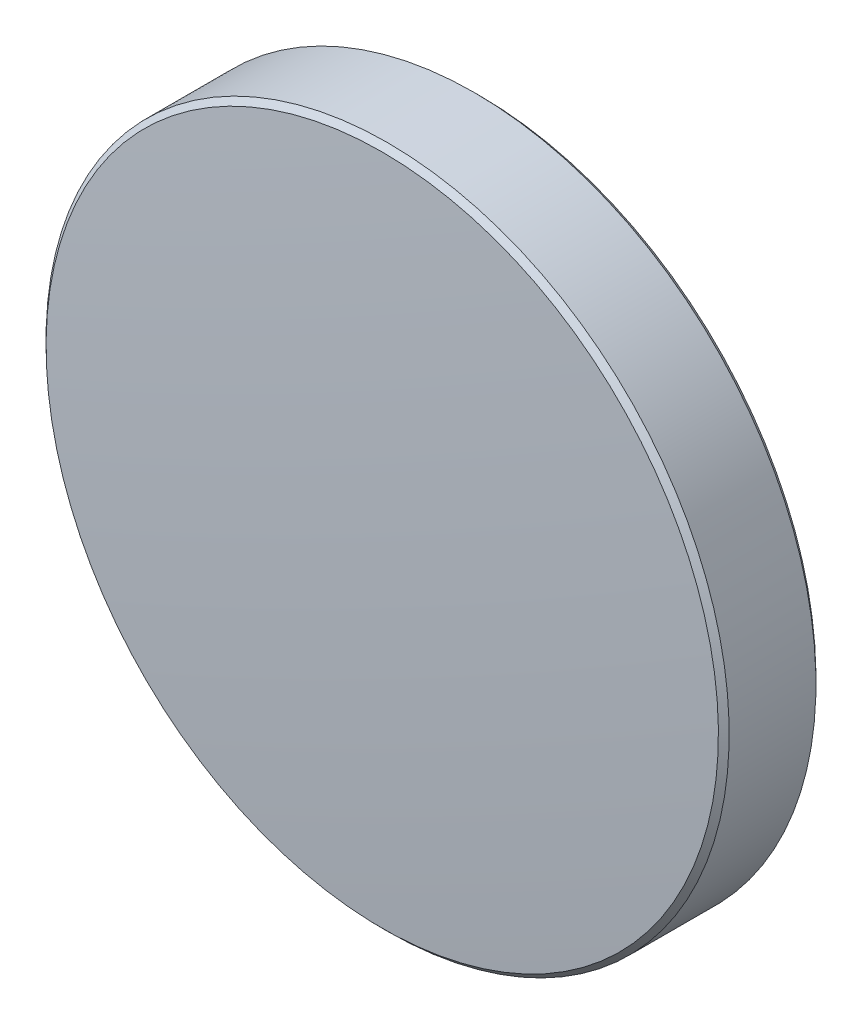
ISO-10303-21;
HEADER;
FILE_DESCRIPTION(('STEP AP214'),'2;1');
FILE_NAME('part.step','',(''),(''),'','','');
FILE_SCHEMA(('AUTOMOTIVE_DESIGN { 1 0 10303 214 1 1 1 1 }'));
ENDSEC;
DATA;
#1=APPLICATION_CONTEXT('core data for automotive mechanical design processes');
#2=APPLICATION_PROTOCOL_DEFINITION('international standard','automotive_design',2000,#1);
#3=PRODUCT_CONTEXT('',#1,'mechanical');
#4=PRODUCT('Part','Part','',(#3));
#5=PRODUCT_RELATED_PRODUCT_CATEGORY('part','',(#4));
#6=PRODUCT_DEFINITION_FORMATION('','',#4);
#7=PRODUCT_DEFINITION_CONTEXT('part definition',#1,'design');
#8=PRODUCT_DEFINITION('design','',#6,#7);
#9=PRODUCT_DEFINITION_SHAPE('','',#8);
#10=(LENGTH_UNIT() NAMED_UNIT(*) SI_UNIT(.MILLI.,.METRE.));
#11=(NAMED_UNIT(*) PLANE_ANGLE_UNIT() SI_UNIT($,.RADIAN.));
#12=(NAMED_UNIT(*) SI_UNIT($,.STERADIAN.) SOLID_ANGLE_UNIT());
#13=UNCERTAINTY_MEASURE_WITH_UNIT(LENGTH_MEASURE(1.E-05),#10,'distance_accuracy_value','');
#14=(GEOMETRIC_REPRESENTATION_CONTEXT(3) GLOBAL_UNCERTAINTY_ASSIGNED_CONTEXT((#13)) GLOBAL_UNIT_ASSIGNED_CONTEXT((#10,
#11,#12)) REPRESENTATION_CONTEXT('',''));
#15=CARTESIAN_POINT('',(0.,0.,0.));
#16=DIRECTION('',(0.,0.,1.));
#17=DIRECTION('',(1.,0.,0.));
#18=AXIS2_PLACEMENT_3D('',#15,#16,#17);
#19=CARTESIAN_POINT('',(0.,0.,-2.));
#20=DIRECTION('',(0.,0.,-1.));
#21=DIRECTION('',(0.,1.,0.));
#22=AXIS2_PLACEMENT_3D('',#19,#20,#21);
#23=CYLINDRICAL_SURFACE('',#22,12.7);
#24=CARTESIAN_POINT('',(0.,0.,1.42586129241057));
#25=DIRECTION('',(0.,0.,-1.));
#26=DIRECTION('',(0.,1.,0.));
#27=AXIS2_PLACEMENT_3D('',#24,#25,#26);
#28=CIRCLE('',#27,12.7);
#29=CARTESIAN_POINT('',(0.,12.7,1.42586129241041));
#30=VERTEX_POINT('',#29);
#31=EDGE_CURVE('E28',#30,#30,#28,.T.);
#32=ORIENTED_EDGE('',*,*,#31,.T.);
#33=EDGE_LOOP('',(#32));
#34=FACE_BOUND('',#33,.T.);
#35=CARTESIAN_POINT('',(0.,0.,-1.79999999999984));
#36=DIRECTION('',(0.,0.,-1.));
#37=DIRECTION('',(0.,1.,0.));
#38=AXIS2_PLACEMENT_3D('',#35,#36,#37);
#39=CIRCLE('',#38,12.7);
#40=CARTESIAN_POINT('',(0.,12.7,-1.8));
#41=VERTEX_POINT('',#40);
#42=EDGE_CURVE('E20',#41,#41,#39,.T.);
#43=ORIENTED_EDGE('',*,*,#42,.F.);
#44=EDGE_LOOP('',(#43));
#45=FACE_BOUND('',#44,.T.);
#46=ADVANCED_FACE('F13',(#34,#45),#23,.T.);
#47=CARTESIAN_POINT('',(0.,0.,-1.79999999999984));
#48=DIRECTION('',(0.,0.,1.));
#49=DIRECTION('',(0.,-1.,0.));
#50=AXIS2_PLACEMENT_3D('',#47,#48,#49);
#51=CONICAL_SURFACE('',#50,12.7,0.785398163397419);
#52=CARTESIAN_POINT('',(0.,0.,-1.99999999999985));
#53=DIRECTION('',(0.,0.,-1.));
#54=DIRECTION('',(0.,1.,0.));
#55=AXIS2_PLACEMENT_3D('',#52,#53,#54);
#56=CIRCLE('',#55,12.5);
#57=CARTESIAN_POINT('',(0.,12.5,-2.00000000000001));
#58=VERTEX_POINT('',#57);
#59=EDGE_CURVE('E9',#58,#58,#56,.T.);
#60=ORIENTED_EDGE('',*,*,#59,.F.);
#61=EDGE_LOOP('',(#60));
#62=FACE_BOUND('',#61,.T.);
#63=ORIENTED_EDGE('',*,*,#42,.T.);
#64=EDGE_LOOP('',(#63));
#65=FACE_BOUND('',#64,.T.);
#66=ADVANCED_FACE('F50',(#62,#65),#51,.T.);
#67=CARTESIAN_POINT('',(0.,0.,-2.));
#68=DIRECTION('',(0.,0.,-1.));
#69=DIRECTION('',(0.,1.,0.));
#70=AXIS2_PLACEMENT_3D('',#67,#68,#69);
#71=PLANE('',#70);
#72=ORIENTED_EDGE('',*,*,#59,.T.);
#73=EDGE_LOOP('',(#72));
#74=FACE_BOUND('',#73,.T.);
#75=ADVANCED_FACE('F15',(#74),#71,.T.);
#76=CARTESIAN_POINT('',(0.,0.,1.62586129241057));
#77=DIRECTION('',(0.,0.,-1.));
#78=DIRECTION('',(0.,1.,0.));
#79=AXIS2_PLACEMENT_3D('',#76,#77,#78);
#80=CONICAL_SURFACE('',#79,12.5,0.785398163397456);
#81=ORIENTED_EDGE('',*,*,#31,.F.);
#82=EDGE_LOOP('',(#81));
#83=FACE_BOUND('',#82,.T.);
#84=CARTESIAN_POINT('',(0.,0.,1.62586129241057));
#85=DIRECTION('',(0.,0.,-1.));
#86=DIRECTION('',(0.,1.,0.));
#87=AXIS2_PLACEMENT_3D('',#84,#85,#86);
#88=CIRCLE('',#87,12.5);
#89=CARTESIAN_POINT('',(0.,12.5,1.62586129241041));
#90=VERTEX_POINT('',#89);
#91=EDGE_CURVE('E24',#90,#90,#88,.T.);
#92=ORIENTED_EDGE('',*,*,#91,.T.);
#93=EDGE_LOOP('',(#92));
#94=FACE_BOUND('',#93,.T.);
#95=ADVANCED_FACE('F36',(#83,#94),#80,.T.);
#96=CARTESIAN_POINT('',(0.,0.,-207.));
#97=DIRECTION('',(0.,0.,-1.));
#98=DIRECTION('',(0.,1.,0.));
#99=AXIS2_PLACEMENT_3D('',#96,#97,#98);
#100=SPHERICAL_SURFACE('',#99,209.);
#101=ORIENTED_EDGE('',*,*,#91,.F.);
#102=EDGE_LOOP('',(#101));
#103=FACE_BOUND('',#102,.T.);
#104=ADVANCED_FACE('F39',(#103),#100,.T.);
#105=CLOSED_SHELL('',(#46,#66,#75,#95,#104));
#106=MANIFOLD_SOLID_BREP('B1',#105);
#107=ADVANCED_BREP_SHAPE_REPRESENTATION('',(#18,#106),#14);
#108=SHAPE_DEFINITION_REPRESENTATION(#9,#107);
ENDSEC;
END-ISO-10303-21;
